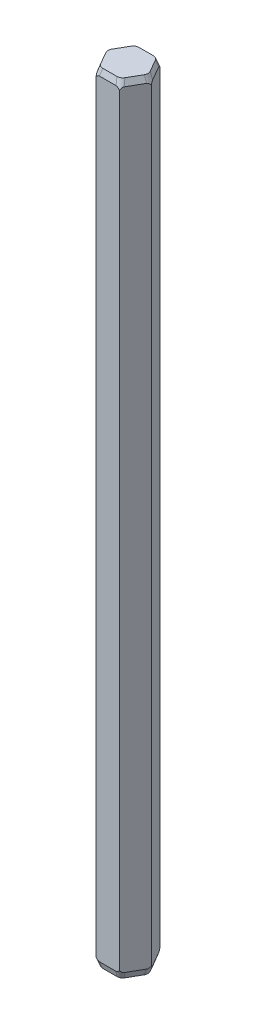
ISO-10303-21;
HEADER;
FILE_DESCRIPTION(('STEP AP214'),'2;1');
FILE_NAME('part.step','',(''),(''),'','','');
FILE_SCHEMA(('AUTOMOTIVE_DESIGN { 1 0 10303 214 1 1 1 1 }'));
ENDSEC;
DATA;
#1=APPLICATION_CONTEXT('core data for automotive mechanical design processes');
#2=APPLICATION_PROTOCOL_DEFINITION('international standard','automotive_design',2000,#1);
#3=PRODUCT_CONTEXT('',#1,'mechanical');
#4=PRODUCT('Part','Part','',(#3));
#5=PRODUCT_RELATED_PRODUCT_CATEGORY('part','',(#4));
#6=PRODUCT_DEFINITION_FORMATION('','',#4);
#7=PRODUCT_DEFINITION_CONTEXT('part definition',#1,'design');
#8=PRODUCT_DEFINITION('design','',#6,#7);
#9=PRODUCT_DEFINITION_SHAPE('','',#8);
#10=(LENGTH_UNIT() NAMED_UNIT(*) SI_UNIT(.MILLI.,.METRE.));
#11=(NAMED_UNIT(*) PLANE_ANGLE_UNIT() SI_UNIT($,.RADIAN.));
#12=(NAMED_UNIT(*) SI_UNIT($,.STERADIAN.) SOLID_ANGLE_UNIT());
#13=UNCERTAINTY_MEASURE_WITH_UNIT(LENGTH_MEASURE(1.E-05),#10,'distance_accuracy_value','');
#14=(GEOMETRIC_REPRESENTATION_CONTEXT(3) GLOBAL_UNCERTAINTY_ASSIGNED_CONTEXT((#13)) GLOBAL_UNIT_ASSIGNED_CONTEXT((#10,
#11,#12)) REPRESENTATION_CONTEXT('',''));
#15=CARTESIAN_POINT('',(0.,0.,0.));
#16=DIRECTION('',(0.,0.,1.));
#17=DIRECTION('',(1.,0.,0.));
#18=AXIS2_PLACEMENT_3D('',#15,#16,#17);
#19=CARTESIAN_POINT('',(0.75,50.,1.29903810567666));
#20=DIRECTION('',(-0.866025403784439,0.,-0.5));
#21=DIRECTION('',(-0.5,0.,0.866025403784439));
#22=AXIS2_PLACEMENT_3D('',#19,#20,#21);
#23=PLANE('',#22);
#24=DIRECTION('',(0.5,0.,-0.866025403784439));
#25=VECTOR('',#24,1.);
#26=CARTESIAN_POINT('',(0.75,0.399999999999991,1.29903810567666));
#27=LINE('',#26,#25);
#28=CARTESIAN_POINT('',(0.859179080829211,0.399999999999991,1.10993439055679));
#29=VERTEX_POINT('',#28);
#30=CARTESIAN_POINT('',(1.39082091917079,0.399999999999991,0.189103715119863));
#31=VERTEX_POINT('',#30);
#32=EDGE_CURVE('E400',#29,#31,#27,.T.);
#33=ORIENTED_EDGE('',*,*,#32,.T.);
#34=CARTESIAN_POINT('',(1.5,1.6286213947029,0.));
#35=DIRECTION('',(-0.866025403784439,0.,-0.5));
#36=DIRECTION('',(-0.0974910391928951,-0.980806805190685,0.168859433164783));
#37=AXIS2_PLACEMENT_3D('',#34,#35,#36);
#38=ELLIPSE('',#37,1.2501375383753,0.4);
#39=CARTESIAN_POINT('',(1.5,0.545970528245343,0.));
#40=VERTEX_POINT('',#39);
#41=EDGE_CURVE('E346',#31,#40,#38,.F.);
#42=ORIENTED_EDGE('',*,*,#41,.T.);
#43=DIRECTION('',(0.,-1.,0.));
#44=VECTOR('',#43,1.);
#45=CARTESIAN_POINT('',(1.5,50.,0.));
#46=LINE('',#45,#44);
#47=CARTESIAN_POINT('',(1.5,49.4540294717547,0.));
#48=VERTEX_POINT('',#47);
#49=EDGE_CURVE('E462',#48,#40,#46,.T.);
#50=ORIENTED_EDGE('',*,*,#49,.F.);
#51=CARTESIAN_POINT('',(1.5,48.3713786052971,0.));
#52=DIRECTION('',(-0.866025403784439,0.,-0.5));
#53=DIRECTION('',(-0.0974910391928951,0.980806805190685,0.168859433164783));
#54=AXIS2_PLACEMENT_3D('',#51,#52,#53);
#55=ELLIPSE('',#54,1.2501375383753,0.4);
#56=CARTESIAN_POINT('',(1.39082091917079,49.6,0.189103715119864));
#57=VERTEX_POINT('',#56);
#58=EDGE_CURVE('E342',#48,#57,#55,.F.);
#59=ORIENTED_EDGE('',*,*,#58,.T.);
#60=DIRECTION('',(-0.5,0.,0.866025403784439));
#61=VECTOR('',#60,1.);
#62=CARTESIAN_POINT('',(0.75,49.6,1.29903810567666));
#63=LINE('',#62,#61);
#64=CARTESIAN_POINT('',(0.859179080829211,49.6,1.10993439055679));
#65=VERTEX_POINT('',#64);
#66=EDGE_CURVE('E388',#57,#65,#63,.T.);
#67=ORIENTED_EDGE('',*,*,#66,.T.);
#68=CARTESIAN_POINT('',(0.75,48.3713786052971,1.29903810567666));
#69=DIRECTION('',(-0.866025403784439,0.,-0.5));
#70=DIRECTION('',(0.0974910391928953,0.980806805190685,-0.168859433164783));
#71=AXIS2_PLACEMENT_3D('',#68,#69,#70);
#72=ELLIPSE('',#71,1.2501375383753,0.4);
#73=CARTESIAN_POINT('',(0.75,49.4540294717547,1.29903810567666));
#74=VERTEX_POINT('',#73);
#75=EDGE_CURVE('E340',#65,#74,#72,.F.);
#76=ORIENTED_EDGE('',*,*,#75,.T.);
#77=DIRECTION('',(0.,-1.,0.));
#78=VECTOR('',#77,1.);
#79=CARTESIAN_POINT('',(0.75,50.,1.29903810567666));
#80=LINE('',#79,#78);
#81=CARTESIAN_POINT('',(0.75,0.545970528245364,1.29903810567666));
#82=VERTEX_POINT('',#81);
#83=EDGE_CURVE('E411',#74,#82,#80,.T.);
#84=ORIENTED_EDGE('',*,*,#83,.T.);
#85=CARTESIAN_POINT('',(0.75,1.6286213947029,1.29903810567666));
#86=DIRECTION('',(-0.866025403784439,0.,-0.5));
#87=DIRECTION('',(0.0974910391928953,-0.980806805190685,-0.168859433164783));
#88=AXIS2_PLACEMENT_3D('',#85,#86,#87);
#89=ELLIPSE('',#88,1.2501375383753,0.4);
#90=EDGE_CURVE('E344',#82,#29,#89,.F.);
#91=ORIENTED_EDGE('',*,*,#90,.T.);
#92=EDGE_LOOP('',(#33,#42,#50,#59,#67,#76,#84,#91));
#93=FACE_BOUND('',#92,.T.);
#94=ADVANCED_FACE('F34',(#93),#23,.F.);
#95=CARTESIAN_POINT('',(1.5,50.,0.));
#96=DIRECTION('',(-0.866025403784439,0.,0.5));
#97=DIRECTION('',(0.5,0.,0.866025403784439));
#98=AXIS2_PLACEMENT_3D('',#95,#96,#97);
#99=PLANE('',#98);
#100=DIRECTION('',(-0.5,0.,-0.866025403784439));
#101=VECTOR('',#100,1.);
#102=CARTESIAN_POINT('',(1.5,0.399999999999991,0.));
#103=LINE('',#102,#101);
#104=CARTESIAN_POINT('',(1.39082091917079,0.399999999999991,-0.189103715119864));
#105=VERTEX_POINT('',#104);
#106=CARTESIAN_POINT('',(0.859179080829211,0.399999999999991,-1.1099343905568));
#107=VERTEX_POINT('',#106);
#108=EDGE_CURVE('E468',#105,#107,#103,.T.);
#109=ORIENTED_EDGE('',*,*,#108,.T.);
#110=CARTESIAN_POINT('',(0.749999999999999,1.6286213947029,-1.29903810567666));
#111=DIRECTION('',(-0.866025403784439,0.,0.5));
#112=DIRECTION('',(-0.0974910391928956,0.980806805190684,-0.168859433164784));
#113=AXIS2_PLACEMENT_3D('',#110,#111,#112);
#114=ELLIPSE('',#113,1.2501375383753,0.4);
#115=CARTESIAN_POINT('',(0.75,0.545970528245364,-1.29903810567666));
#116=VERTEX_POINT('',#115);
#117=EDGE_CURVE('E333',#107,#116,#114,.F.);
#118=ORIENTED_EDGE('',*,*,#117,.T.);
#119=DIRECTION('',(0.,-1.,0.));
#120=VECTOR('',#119,1.);
#121=CARTESIAN_POINT('',(0.75,50.,-1.29903810567666));
#122=LINE('',#121,#120);
#123=CARTESIAN_POINT('',(0.75,49.4540294717547,-1.29903810567666));
#124=VERTEX_POINT('',#123);
#125=EDGE_CURVE('E239',#124,#116,#122,.T.);
#126=ORIENTED_EDGE('',*,*,#125,.F.);
#127=CARTESIAN_POINT('',(0.749999999999999,48.3713786052971,-1.29903810567666));
#128=DIRECTION('',(-0.866025403784439,0.,0.5));
#129=DIRECTION('',(0.0974910391928956,0.980806805190684,0.168859433164784));
#130=AXIS2_PLACEMENT_3D('',#127,#128,#129);
#131=ELLIPSE('',#130,1.2501375383753,0.4);
#132=CARTESIAN_POINT('',(0.859179080829211,49.6,-1.10993439055679));
#133=VERTEX_POINT('',#132);
#134=EDGE_CURVE('E329',#124,#133,#131,.F.);
#135=ORIENTED_EDGE('',*,*,#134,.T.);
#136=DIRECTION('',(0.5,0.,0.866025403784439));
#137=VECTOR('',#136,1.);
#138=CARTESIAN_POINT('',(1.5,49.6,0.));
#139=LINE('',#138,#137);
#140=CARTESIAN_POINT('',(1.39082091917079,49.6,-0.189103715119865));
#141=VERTEX_POINT('',#140);
#142=EDGE_CURVE('E465',#133,#141,#139,.T.);
#143=ORIENTED_EDGE('',*,*,#142,.T.);
#144=CARTESIAN_POINT('',(1.5,48.3713786052971,0.));
#145=DIRECTION('',(-0.866025403784439,0.,0.5));
#146=DIRECTION('',(-0.0974910391928956,0.980806805190684,-0.168859433164784));
#147=AXIS2_PLACEMENT_3D('',#144,#145,#146);
#148=ELLIPSE('',#147,1.2501375383753,0.4);
#149=EDGE_CURVE('E327',#141,#48,#148,.F.);
#150=ORIENTED_EDGE('',*,*,#149,.T.);
#151=ORIENTED_EDGE('',*,*,#49,.T.);
#152=CARTESIAN_POINT('',(1.5,1.6286213947029,0.));
#153=DIRECTION('',(-0.866025403784439,0.,0.5));
#154=DIRECTION('',(-0.0974910391928956,-0.980806805190684,-0.168859433164784));
#155=AXIS2_PLACEMENT_3D('',#152,#153,#154);
#156=ELLIPSE('',#155,1.2501375383753,0.4);
#157=EDGE_CURVE('E331',#40,#105,#156,.F.);
#158=ORIENTED_EDGE('',*,*,#157,.T.);
#159=EDGE_LOOP('',(#109,#118,#126,#135,#143,#150,#151,#158));
#160=FACE_BOUND('',#159,.T.);
#161=ADVANCED_FACE('F553',(#160),#99,.F.);
#162=CARTESIAN_POINT('',(0.75,50.,-1.29903810567666));
#163=DIRECTION('',(0.,0.,1.));
#164=DIRECTION('',(1.,0.,0.));
#165=AXIS2_PLACEMENT_3D('',#162,#163,#164);
#166=PLANE('',#165);
#167=DIRECTION('',(-1.,0.,0.));
#168=VECTOR('',#167,1.);
#169=CARTESIAN_POINT('',(0.75,0.399999999999991,-1.29903810567666));
#170=LINE('',#169,#168);
#171=CARTESIAN_POINT('',(0.531641838341576,0.399999999999991,-1.29903810567666));
#172=VERTEX_POINT('',#171);
#173=CARTESIAN_POINT('',(-0.531641838341577,0.399999999999991,-1.29903810567666));
#174=VERTEX_POINT('',#173);
#175=EDGE_CURVE('E237',#172,#174,#170,.T.);
#176=ORIENTED_EDGE('',*,*,#175,.T.);
#177=CARTESIAN_POINT('',(-0.749999999999998,1.6286213947029,-1.29903810567666));
#178=DIRECTION('',(0.,0.,1.));
#179=DIRECTION('',(-0.19498207838579,0.980806805190685,0.));
#180=AXIS2_PLACEMENT_3D('',#177,#178,#179);
#181=ELLIPSE('',#180,1.2501375383753,0.4);
#182=CARTESIAN_POINT('',(-0.75,0.54597052824535,-1.29903810567666));
#183=VERTEX_POINT('',#182);
#184=EDGE_CURVE('E242',#174,#183,#181,.F.);
#185=ORIENTED_EDGE('',*,*,#184,.T.);
#186=DIRECTION('',(0.,-1.,0.));
#187=VECTOR('',#186,1.);
#188=CARTESIAN_POINT('',(-0.75,50.,-1.29903810567666));
#189=LINE('',#188,#187);
#190=CARTESIAN_POINT('',(-0.75,49.4540294717547,-1.29903810567666));
#191=VERTEX_POINT('',#190);
#192=EDGE_CURVE('E455',#191,#183,#189,.T.);
#193=ORIENTED_EDGE('',*,*,#192,.F.);
#194=CARTESIAN_POINT('',(-0.749999999999998,48.3713786052971,-1.29903810567666));
#195=DIRECTION('',(0.,0.,1.));
#196=DIRECTION('',(-0.19498207838579,-0.980806805190685,0.));
#197=AXIS2_PLACEMENT_3D('',#194,#195,#196);
#198=ELLIPSE('',#197,1.2501375383753,0.4);
#199=CARTESIAN_POINT('',(-0.531641838341576,49.6,-1.29903810567666));
#200=VERTEX_POINT('',#199);
#201=EDGE_CURVE('E243',#191,#200,#198,.F.);
#202=ORIENTED_EDGE('',*,*,#201,.T.);
#203=DIRECTION('',(1.,0.,0.));
#204=VECTOR('',#203,1.);
#205=CARTESIAN_POINT('',(0.75,49.6,-1.29903810567666));
#206=LINE('',#205,#204);
#207=CARTESIAN_POINT('',(0.531641838341576,49.6,-1.29903810567666));
#208=VERTEX_POINT('',#207);
#209=EDGE_CURVE('E254',#200,#208,#206,.T.);
#210=ORIENTED_EDGE('',*,*,#209,.T.);
#211=CARTESIAN_POINT('',(0.749999999999999,48.3713786052971,-1.29903810567666));
#212=DIRECTION('',(0.,0.,1.));
#213=DIRECTION('',(-0.19498207838579,0.980806805190685,0.));
#214=AXIS2_PLACEMENT_3D('',#211,#212,#213);
#215=ELLIPSE('',#214,1.2501375383753,0.4);
#216=EDGE_CURVE('E262',#208,#124,#215,.F.);
#217=ORIENTED_EDGE('',*,*,#216,.T.);
#218=ORIENTED_EDGE('',*,*,#125,.T.);
#219=CARTESIAN_POINT('',(0.749999999999998,1.6286213947029,-1.29903810567666));
#220=DIRECTION('',(0.,0.,1.));
#221=DIRECTION('',(0.19498207838579,0.980806805190685,0.));
#222=AXIS2_PLACEMENT_3D('',#219,#220,#221);
#223=ELLIPSE('',#222,1.2501375383753,0.4);
#224=EDGE_CURVE('E234',#116,#172,#223,.F.);
#225=ORIENTED_EDGE('',*,*,#224,.T.);
#226=EDGE_LOOP('',(#176,#185,#193,#202,#210,#217,#218,#225));
#227=FACE_BOUND('',#226,.T.);
#228=ADVANCED_FACE('F236',(#227),#166,.F.);
#229=CARTESIAN_POINT('',(-0.75,50.,-1.29903810567666));
#230=DIRECTION('',(0.866025403784439,0.,0.5));
#231=DIRECTION('',(0.5,0.,-0.866025403784439));
#232=AXIS2_PLACEMENT_3D('',#229,#230,#231);
#233=PLANE('',#232);
#234=ORIENTED_EDGE('',*,*,#192,.T.);
#235=CARTESIAN_POINT('',(-0.749999999999999,1.6286213947029,-1.29903810567666));
#236=DIRECTION('',(0.866025403784439,0.,0.5));
#237=DIRECTION('',(0.0974910391928957,0.980806805190684,-0.168859433164784));
#238=AXIS2_PLACEMENT_3D('',#235,#236,#237);
#239=ELLIPSE('',#238,1.2501375383753,0.4);
#240=CARTESIAN_POINT('',(-0.859179080829211,0.399999999999991,-1.10993439055679));
#241=VERTEX_POINT('',#240);
#242=EDGE_CURVE('E278',#183,#241,#239,.F.);
#243=ORIENTED_EDGE('',*,*,#242,.T.);
#244=DIRECTION('',(-0.5,0.,0.866025403784439));
#245=VECTOR('',#244,1.);
#246=CARTESIAN_POINT('',(-0.75,0.399999999999991,-1.29903810567666));
#247=LINE('',#246,#245);
#248=CARTESIAN_POINT('',(-1.39082091917079,0.399999999999991,-0.189103715119864));
#249=VERTEX_POINT('',#248);
#250=EDGE_CURVE('E492',#241,#249,#247,.T.);
#251=ORIENTED_EDGE('',*,*,#250,.T.);
#252=CARTESIAN_POINT('',(-1.5,1.6286213947029,0.));
#253=DIRECTION('',(0.866025403784439,0.,0.5));
#254=DIRECTION('',(-0.0974910391928953,0.980806805190685,0.168859433164783));
#255=AXIS2_PLACEMENT_3D('',#252,#253,#254);
#256=ELLIPSE('',#255,1.2501375383753,0.4);
#257=CARTESIAN_POINT('',(-1.5,0.545970528245364,0.));
#258=VERTEX_POINT('',#257);
#259=EDGE_CURVE('E276',#249,#258,#256,.F.);
#260=ORIENTED_EDGE('',*,*,#259,.T.);
#261=DIRECTION('',(0.,-1.,0.));
#262=VECTOR('',#261,1.);
#263=CARTESIAN_POINT('',(-1.5,50.,0.));
#264=LINE('',#263,#262);
#265=CARTESIAN_POINT('',(-1.5,49.4540294717547,0.));
#266=VERTEX_POINT('',#265);
#267=EDGE_CURVE('E453',#266,#258,#264,.T.);
#268=ORIENTED_EDGE('',*,*,#267,.F.);
#269=CARTESIAN_POINT('',(-1.5,48.3713786052971,0.));
#270=DIRECTION('',(0.866025403784439,0.,0.5));
#271=DIRECTION('',(-0.0974910391928953,-0.980806805190685,0.168859433164783));
#272=AXIS2_PLACEMENT_3D('',#269,#270,#271);
#273=ELLIPSE('',#272,1.2501375383753,0.4);
#274=CARTESIAN_POINT('',(-1.39082091917079,49.6,-0.189103715119864));
#275=VERTEX_POINT('',#274);
#276=EDGE_CURVE('E274',#266,#275,#273,.F.);
#277=ORIENTED_EDGE('',*,*,#276,.T.);
#278=DIRECTION('',(0.5,0.,-0.866025403784439));
#279=VECTOR('',#278,1.);
#280=CARTESIAN_POINT('',(-0.75,49.6,-1.29903810567666));
#281=LINE('',#280,#279);
#282=CARTESIAN_POINT('',(-0.859179080829212,49.6,-1.10993439055679));
#283=VERTEX_POINT('',#282);
#284=EDGE_CURVE('E253',#275,#283,#281,.T.);
#285=ORIENTED_EDGE('',*,*,#284,.T.);
#286=CARTESIAN_POINT('',(-0.749999999999999,48.3713786052971,-1.29903810567666));
#287=DIRECTION('',(0.866025403784439,0.,0.5));
#288=DIRECTION('',(0.0974910391928957,-0.980806805190684,-0.168859433164784));
#289=AXIS2_PLACEMENT_3D('',#286,#287,#288);
#290=ELLIPSE('',#289,1.2501375383753,0.4);
#291=EDGE_CURVE('E272',#283,#191,#290,.F.);
#292=ORIENTED_EDGE('',*,*,#291,.T.);
#293=EDGE_LOOP('',(#234,#243,#251,#260,#268,#277,#285,#292));
#294=FACE_BOUND('',#293,.T.);
#295=ADVANCED_FACE('F500',(#294),#233,.F.);
#296=CARTESIAN_POINT('',(-1.5,50.,0.));
#297=DIRECTION('',(0.866025403784439,0.,-0.5));
#298=DIRECTION('',(-0.5,0.,-0.866025403784439));
#299=AXIS2_PLACEMENT_3D('',#296,#297,#298);
#300=PLANE('',#299);
#301=ORIENTED_EDGE('',*,*,#267,.T.);
#302=CARTESIAN_POINT('',(-1.5,1.6286213947029,0.));
#303=DIRECTION('',(0.866025403784439,0.,-0.5));
#304=DIRECTION('',(-0.0974910391928952,0.980806805190685,-0.168859433164783));
#305=AXIS2_PLACEMENT_3D('',#302,#303,#304);
#306=ELLIPSE('',#305,1.2501375383753,0.4);
#307=CARTESIAN_POINT('',(-1.39082091917079,0.399999999999991,0.189103715119863));
#308=VERTEX_POINT('',#307);
#309=EDGE_CURVE('E302',#258,#308,#306,.F.);
#310=ORIENTED_EDGE('',*,*,#309,.T.);
#311=DIRECTION('',(0.5,0.,0.866025403784439));
#312=VECTOR('',#311,1.);
#313=CARTESIAN_POINT('',(-1.5,0.399999999999991,0.));
#314=LINE('',#313,#312);
#315=CARTESIAN_POINT('',(-0.859179080829212,0.399999999999991,1.10993439055679));
#316=VERTEX_POINT('',#315);
#317=EDGE_CURVE('E416',#308,#316,#314,.T.);
#318=ORIENTED_EDGE('',*,*,#317,.T.);
#319=CARTESIAN_POINT('',(-0.75,1.6286213947029,1.29903810567666));
#320=DIRECTION('',(0.866025403784439,0.,-0.5));
#321=DIRECTION('',(-0.0974910391928954,-0.980806805190685,-0.168859433164784));
#322=AXIS2_PLACEMENT_3D('',#319,#320,#321);
#323=ELLIPSE('',#322,1.2501375383753,0.4);
#324=CARTESIAN_POINT('',(-0.75,0.54597052824535,1.29903810567666));
#325=VERTEX_POINT('',#324);
#326=EDGE_CURVE('E300',#316,#325,#323,.F.);
#327=ORIENTED_EDGE('',*,*,#326,.T.);
#328=DIRECTION('',(0.,-1.,0.));
#329=VECTOR('',#328,1.);
#330=CARTESIAN_POINT('',(-0.75,50.,1.29903810567666));
#331=LINE('',#330,#329);
#332=CARTESIAN_POINT('',(-0.75,49.4540294717547,1.29903810567666));
#333=VERTEX_POINT('',#332);
#334=EDGE_CURVE('E445',#333,#325,#331,.T.);
#335=ORIENTED_EDGE('',*,*,#334,.F.);
#336=CARTESIAN_POINT('',(-0.75,48.3713786052971,1.29903810567666));
#337=DIRECTION('',(0.866025403784439,0.,-0.5));
#338=DIRECTION('',(0.0974910391928954,-0.980806805190685,0.168859433164784));
#339=AXIS2_PLACEMENT_3D('',#336,#337,#338);
#340=ELLIPSE('',#339,1.2501375383753,0.4);
#341=CARTESIAN_POINT('',(-0.859179080829212,49.6,1.10993439055679));
#342=VERTEX_POINT('',#341);
#343=EDGE_CURVE('E298',#333,#342,#340,.F.);
#344=ORIENTED_EDGE('',*,*,#343,.T.);
#345=DIRECTION('',(-0.5,0.,-0.866025403784439));
#346=VECTOR('',#345,1.);
#347=CARTESIAN_POINT('',(-1.5,49.6,0.));
#348=LINE('',#347,#346);
#349=CARTESIAN_POINT('',(-1.39082091917079,49.6,0.189103715119864));
#350=VERTEX_POINT('',#349);
#351=EDGE_CURVE('E421',#342,#350,#348,.T.);
#352=ORIENTED_EDGE('',*,*,#351,.T.);
#353=CARTESIAN_POINT('',(-1.5,48.3713786052971,0.));
#354=DIRECTION('',(0.866025403784439,0.,-0.5));
#355=DIRECTION('',(-0.0974910391928952,-0.980806805190685,-0.168859433164783));
#356=AXIS2_PLACEMENT_3D('',#353,#354,#355);
#357=ELLIPSE('',#356,1.2501375383753,0.4);
#358=EDGE_CURVE('E296',#350,#266,#357,.F.);
#359=ORIENTED_EDGE('',*,*,#358,.T.);
#360=EDGE_LOOP('',(#301,#310,#318,#327,#335,#344,#352,#359));
#361=FACE_BOUND('',#360,.T.);
#362=ADVANCED_FACE('F449',(#361),#300,.F.);
#363=CARTESIAN_POINT('',(-0.75,50.,1.29903810567666));
#364=DIRECTION('',(0.,0.,-1.));
#365=DIRECTION('',(-1.,0.,0.));
#366=AXIS2_PLACEMENT_3D('',#363,#364,#365);
#367=PLANE('',#366);
#368=ORIENTED_EDGE('',*,*,#334,.T.);
#369=CARTESIAN_POINT('',(-0.75,1.6286213947029,1.29903810567666));
#370=DIRECTION('',(0.,0.,-1.));
#371=DIRECTION('',(0.19498207838579,-0.980806805190685,0.));
#372=AXIS2_PLACEMENT_3D('',#369,#370,#371);
#373=ELLIPSE('',#372,1.2501375383753,0.4);
#374=CARTESIAN_POINT('',(-0.531641838341577,0.399999999999991,1.29903810567666));
#375=VERTEX_POINT('',#374);
#376=EDGE_CURVE('E319',#325,#375,#373,.F.);
#377=ORIENTED_EDGE('',*,*,#376,.T.);
#378=DIRECTION('',(1.,0.,0.));
#379=VECTOR('',#378,1.);
#380=CARTESIAN_POINT('',(-0.75,0.399999999999991,1.29903810567666));
#381=LINE('',#380,#379);
#382=CARTESIAN_POINT('',(0.531641838341577,0.399999999999991,1.29903810567666));
#383=VERTEX_POINT('',#382);
#384=EDGE_CURVE('E401',#375,#383,#381,.T.);
#385=ORIENTED_EDGE('',*,*,#384,.T.);
#386=CARTESIAN_POINT('',(0.75,1.6286213947029,1.29903810567666));
#387=DIRECTION('',(0.,0.,-1.));
#388=DIRECTION('',(-0.194982078385791,-0.980806805190685,0.));
#389=AXIS2_PLACEMENT_3D('',#386,#387,#388);
#390=ELLIPSE('',#389,1.2501375383753,0.4);
#391=EDGE_CURVE('E317',#383,#82,#390,.F.);
#392=ORIENTED_EDGE('',*,*,#391,.T.);
#393=ORIENTED_EDGE('',*,*,#83,.F.);
#394=CARTESIAN_POINT('',(0.75,48.3713786052971,1.29903810567666));
#395=DIRECTION('',(0.,0.,-1.));
#396=DIRECTION('',(-0.194982078385791,0.980806805190685,0.));
#397=AXIS2_PLACEMENT_3D('',#394,#395,#396);
#398=ELLIPSE('',#397,1.2501375383753,0.4);
#399=CARTESIAN_POINT('',(0.531641838341576,49.6,1.29903810567666));
#400=VERTEX_POINT('',#399);
#401=EDGE_CURVE('E313',#74,#400,#398,.F.);
#402=ORIENTED_EDGE('',*,*,#401,.T.);
#403=DIRECTION('',(-1.,0.,0.));
#404=VECTOR('',#403,1.);
#405=CARTESIAN_POINT('',(-0.75,49.6,1.29903810567666));
#406=LINE('',#405,#404);
#407=CARTESIAN_POINT('',(-0.531641838341577,49.6,1.29903810567666));
#408=VERTEX_POINT('',#407);
#409=EDGE_CURVE('E410',#400,#408,#406,.T.);
#410=ORIENTED_EDGE('',*,*,#409,.T.);
#411=CARTESIAN_POINT('',(-0.75,48.3713786052971,1.29903810567666));
#412=DIRECTION('',(0.,0.,-1.));
#413=DIRECTION('',(-0.19498207838579,-0.980806805190685,0.));
#414=AXIS2_PLACEMENT_3D('',#411,#412,#413);
#415=ELLIPSE('',#414,1.2501375383753,0.4);
#416=EDGE_CURVE('E315',#408,#333,#415,.F.);
#417=ORIENTED_EDGE('',*,*,#416,.T.);
#418=EDGE_LOOP('',(#368,#377,#385,#392,#393,#402,#410,#417));
#419=FACE_BOUND('',#418,.T.);
#420=ADVANCED_FACE('F409',(#419),#367,.F.);
#421=CARTESIAN_POINT('',(1.5,50.,0.));
#422=DIRECTION('',(0.,1.,0.));
#423=DIRECTION('',(0.,0.,1.));
#424=AXIS2_PLACEMENT_3D('',#421,#422,#423);
#425=PLANE('',#424);
#426=DIRECTION('',(0.5,0.,0.866025403784439));
#427=VECTOR('',#426,1.);
#428=CARTESIAN_POINT('',(-0.630721415866678,50.,1.23017258301873));
#429=LINE('',#428,#427);
#430=CARTESIAN_POINT('',(-1.23178280699303,50.,0.189103715119864));
#431=VERTEX_POINT('',#430);
#432=CARTESIAN_POINT('',(-0.779660024740331,50.,0.972203345240932));
#433=VERTEX_POINT('',#432);
#434=EDGE_CURVE('E265',#431,#433,#429,.T.);
#435=ORIENTED_EDGE('',*,*,#434,.T.);
#436=CARTESIAN_POINT('',(-0.426233909917664,50.,0.738258787886129));
#437=DIRECTION('',(0.,1.,0.));
#438=DIRECTION('',(-0.499999999999999,0.,0.866025403784439));
#439=AXIS2_PLACEMENT_3D('',#436,#437,#438);
#440=ELLIPSE('',#439,0.43045687487258,0.4);
#441=CARTESIAN_POINT('',(-0.452122782252696,50.,1.1613070603608));
#442=VERTEX_POINT('',#441);
#443=EDGE_CURVE('E368',#433,#442,#440,.T.);
#444=ORIENTED_EDGE('',*,*,#443,.T.);
#445=DIRECTION('',(1.,0.,0.));
#446=VECTOR('',#445,1.);
#447=CARTESIAN_POINT('',(0.75,50.,1.1613070603608));
#448=LINE('',#447,#446);
#449=CARTESIAN_POINT('',(0.452122782252695,50.,1.1613070603608));
#450=VERTEX_POINT('',#449);
#451=EDGE_CURVE('E260',#442,#450,#448,.T.);
#452=ORIENTED_EDGE('',*,*,#451,.T.);
#453=CARTESIAN_POINT('',(0.426233909917663,50.,0.738258787886129));
#454=DIRECTION('',(0.,1.,0.));
#455=DIRECTION('',(-0.500000000000001,0.,-0.866025403784438));
#456=AXIS2_PLACEMENT_3D('',#453,#454,#455);
#457=ELLIPSE('',#456,0.43045687487258,0.4);
#458=CARTESIAN_POINT('',(0.77966002474033,50.,0.972203345240933));
#459=VERTEX_POINT('',#458);
#460=EDGE_CURVE('E359',#450,#459,#457,.T.);
#461=ORIENTED_EDGE('',*,*,#460,.T.);
#462=DIRECTION('',(0.5,0.,-0.866025403784439));
#463=VECTOR('',#462,1.);
#464=CARTESIAN_POINT('',(1.38072141586668,50.,-0.0688655226579313));
#465=LINE('',#464,#463);
#466=CARTESIAN_POINT('',(1.23178280699303,50.,0.189103715119864));
#467=VERTEX_POINT('',#466);
#468=EDGE_CURVE('E391',#459,#467,#465,.T.);
#469=ORIENTED_EDGE('',*,*,#468,.T.);
#470=CARTESIAN_POINT('',(0.852467819835324,50.,0.));
#471=DIRECTION('',(0.,1.,0.));
#472=DIRECTION('',(-1.,0.,0.));
#473=AXIS2_PLACEMENT_3D('',#470,#471,#472);
#474=ELLIPSE('',#473,0.43045687487258,0.4);
#475=CARTESIAN_POINT('',(1.23178280699303,50.,-0.189103715119865));
#476=VERTEX_POINT('',#475);
#477=EDGE_CURVE('E361',#467,#476,#474,.T.);
#478=ORIENTED_EDGE('',*,*,#477,.T.);
#479=DIRECTION('',(-0.5,0.,-0.866025403784439));
#480=VECTOR('',#479,1.);
#481=CARTESIAN_POINT('',(0.630721415866678,50.,-1.23017258301873));
#482=LINE('',#481,#480);
#483=CARTESIAN_POINT('',(0.77966002474033,50.,-0.972203345240932));
#484=VERTEX_POINT('',#483);
#485=EDGE_CURVE('E427',#476,#484,#482,.T.);
#486=ORIENTED_EDGE('',*,*,#485,.T.);
#487=CARTESIAN_POINT('',(0.426233909917663,50.,-0.738258787886128));
#488=DIRECTION('',(0.,1.,0.));
#489=DIRECTION('',(-0.499999999999999,0.,0.866025403784439));
#490=AXIS2_PLACEMENT_3D('',#487,#488,#489);
#491=ELLIPSE('',#490,0.43045687487258,0.4);
#492=CARTESIAN_POINT('',(0.452122782252695,50.,-1.1613070603608));
#493=VERTEX_POINT('',#492);
#494=EDGE_CURVE('E363',#484,#493,#491,.T.);
#495=ORIENTED_EDGE('',*,*,#494,.T.);
#496=DIRECTION('',(-1.,0.,0.));
#497=VECTOR('',#496,1.);
#498=CARTESIAN_POINT('',(-0.75,50.,-1.1613070603608));
#499=LINE('',#498,#497);
#500=CARTESIAN_POINT('',(-0.452122782252695,50.,-1.1613070603608));
#501=VERTEX_POINT('',#500);
#502=EDGE_CURVE('E430',#493,#501,#499,.T.);
#503=ORIENTED_EDGE('',*,*,#502,.T.);
#504=CARTESIAN_POINT('',(-0.426233909917662,50.,-0.738258787886127));
#505=DIRECTION('',(0.,1.,0.));
#506=DIRECTION('',(-0.499999999999998,0.,-0.86602540378444));
#507=AXIS2_PLACEMENT_3D('',#504,#505,#506);
#508=ELLIPSE('',#507,0.43045687487258,0.4);
#509=CARTESIAN_POINT('',(-0.779660024740331,50.,-0.972203345240932));
#510=VERTEX_POINT('',#509);
#511=EDGE_CURVE('E56',#501,#510,#508,.T.);
#512=ORIENTED_EDGE('',*,*,#511,.T.);
#513=DIRECTION('',(-0.5,0.,0.866025403784439));
#514=VECTOR('',#513,1.);
#515=CARTESIAN_POINT('',(-1.38072141586668,50.,0.0688655226579305));
#516=LINE('',#515,#514);
#517=CARTESIAN_POINT('',(-1.23178280699303,50.,-0.189103715119865));
#518=VERTEX_POINT('',#517);
#519=EDGE_CURVE('E432',#510,#518,#516,.T.);
#520=ORIENTED_EDGE('',*,*,#519,.T.);
#521=CARTESIAN_POINT('',(-0.852467819835326,50.,0.));
#522=DIRECTION('',(0.,1.,0.));
#523=DIRECTION('',(-1.,0.,0.));
#524=AXIS2_PLACEMENT_3D('',#521,#522,#523);
#525=ELLIPSE('',#524,0.43045687487258,0.4);
#526=EDGE_CURVE('E366',#518,#431,#525,.T.);
#527=ORIENTED_EDGE('',*,*,#526,.T.);
#528=EDGE_LOOP('',(#435,#444,#452,#461,#469,#478,#486,#495,#503,#512,#520,#527));
#529=FACE_BOUND('',#528,.T.);
#530=ADVANCED_FACE('F436',(#529),#425,.T.);
#531=CARTESIAN_POINT('',(1.5,0.,0.));
#532=DIRECTION('',(0.,1.,0.));
#533=DIRECTION('',(0.,0.,1.));
#534=AXIS2_PLACEMENT_3D('',#531,#532,#533);
#535=PLANE('',#534);
#536=DIRECTION('',(0.5,0.,-0.866025403784439));
#537=VECTOR('',#536,1.);
#538=CARTESIAN_POINT('',(-0.630721415866678,0.,-1.23017258301873));
#539=LINE('',#538,#537);
#540=CARTESIAN_POINT('',(-1.23178280699303,0.,-0.189103715119864));
#541=VERTEX_POINT('',#540);
#542=CARTESIAN_POINT('',(-0.77966002474033,0.,-0.972203345240933));
#543=VERTEX_POINT('',#542);
#544=EDGE_CURVE('E480',#541,#543,#539,.T.);
#545=ORIENTED_EDGE('',*,*,#544,.T.);
#546=CARTESIAN_POINT('',(-0.426233909917663,0.,-0.738258787886129));
#547=DIRECTION('',(0.,1.,0.));
#548=DIRECTION('',(-0.499999999999998,0.,-0.86602540378444));
#549=AXIS2_PLACEMENT_3D('',#546,#547,#548);
#550=ELLIPSE('',#549,0.43045687487258,0.4);
#551=CARTESIAN_POINT('',(-0.452122782252696,0.,-1.1613070603608));
#552=VERTEX_POINT('',#551);
#553=EDGE_CURVE('E294',#543,#552,#550,.F.);
#554=ORIENTED_EDGE('',*,*,#553,.T.);
#555=DIRECTION('',(1.,0.,0.));
#556=VECTOR('',#555,1.);
#557=CARTESIAN_POINT('',(1.5,0.,-1.1613070603608));
#558=LINE('',#557,#556);
#559=CARTESIAN_POINT('',(0.452122782252695,0.,-1.1613070603608));
#560=VERTEX_POINT('',#559);
#561=EDGE_CURVE('E483',#552,#560,#558,.T.);
#562=ORIENTED_EDGE('',*,*,#561,.T.);
#563=CARTESIAN_POINT('',(0.426233909917663,0.,-0.738258787886129));
#564=DIRECTION('',(0.,1.,0.));
#565=DIRECTION('',(0.499999999999999,0.,-0.866025403784439));
#566=AXIS2_PLACEMENT_3D('',#563,#564,#565);
#567=ELLIPSE('',#566,0.43045687487258,0.4);
#568=CARTESIAN_POINT('',(0.77966002474033,0.,-0.972203345240934));
#569=VERTEX_POINT('',#568);
#570=EDGE_CURVE('E259',#560,#569,#567,.F.);
#571=ORIENTED_EDGE('',*,*,#570,.T.);
#572=DIRECTION('',(0.5,0.,0.866025403784439));
#573=VECTOR('',#572,1.);
#574=CARTESIAN_POINT('',(1.38072141586668,0.,0.0688655226579303));
#575=LINE('',#574,#573);
#576=CARTESIAN_POINT('',(1.23178280699303,0.,-0.189103715119864));
#577=VERTEX_POINT('',#576);
#578=EDGE_CURVE('E485',#569,#577,#575,.T.);
#579=ORIENTED_EDGE('',*,*,#578,.T.);
#580=CARTESIAN_POINT('',(0.852467819835326,0.,0.));
#581=DIRECTION('',(0.,1.,0.));
#582=DIRECTION('',(-1.,0.,0.));
#583=AXIS2_PLACEMENT_3D('',#580,#581,#582);
#584=ELLIPSE('',#583,0.43045687487258,0.4);
#585=CARTESIAN_POINT('',(1.23178280699303,0.,0.189103715119863));
#586=VERTEX_POINT('',#585);
#587=EDGE_CURVE('E287',#577,#586,#584,.F.);
#588=ORIENTED_EDGE('',*,*,#587,.T.);
#589=DIRECTION('',(-0.5,0.,0.866025403784439));
#590=VECTOR('',#589,1.);
#591=CARTESIAN_POINT('',(1.38072141586668,0.,-0.0688655226579313));
#592=LINE('',#591,#590);
#593=CARTESIAN_POINT('',(0.77966002474033,0.,0.972203345240933));
#594=VERTEX_POINT('',#593);
#595=EDGE_CURVE('E471',#586,#594,#592,.T.);
#596=ORIENTED_EDGE('',*,*,#595,.T.);
#597=CARTESIAN_POINT('',(0.426233909917663,0.,0.738258787886129));
#598=DIRECTION('',(0.,1.,0.));
#599=DIRECTION('',(-0.500000000000001,0.,-0.866025403784438));
#600=AXIS2_PLACEMENT_3D('',#597,#598,#599);
#601=ELLIPSE('',#600,0.43045687487258,0.4);
#602=CARTESIAN_POINT('',(0.452122782252695,0.,1.1613070603608));
#603=VERTEX_POINT('',#602);
#604=EDGE_CURVE('E285',#594,#603,#601,.F.);
#605=ORIENTED_EDGE('',*,*,#604,.T.);
#606=DIRECTION('',(-1.,0.,0.));
#607=VECTOR('',#606,1.);
#608=CARTESIAN_POINT('',(1.5,0.,1.1613070603608));
#609=LINE('',#608,#607);
#610=CARTESIAN_POINT('',(-0.452122782252696,0.,1.1613070603608));
#611=VERTEX_POINT('',#610);
#612=EDGE_CURVE('E474',#603,#611,#609,.T.);
#613=ORIENTED_EDGE('',*,*,#612,.T.);
#614=CARTESIAN_POINT('',(-0.426233909917664,0.,0.738258787886128));
#615=DIRECTION('',(0.,1.,0.));
#616=DIRECTION('',(0.499999999999999,0.,-0.866025403784439));
#617=AXIS2_PLACEMENT_3D('',#614,#615,#616);
#618=ELLIPSE('',#617,0.43045687487258,0.4);
#619=CARTESIAN_POINT('',(-0.779660024740331,0.,0.972203345240933));
#620=VERTEX_POINT('',#619);
#621=EDGE_CURVE('E290',#611,#620,#618,.F.);
#622=ORIENTED_EDGE('',*,*,#621,.T.);
#623=DIRECTION('',(-0.5,0.,-0.866025403784439));
#624=VECTOR('',#623,1.);
#625=CARTESIAN_POINT('',(-0.630721415866679,0.,1.23017258301873));
#626=LINE('',#625,#624);
#627=CARTESIAN_POINT('',(-1.23178280699303,0.,0.189103715119863));
#628=VERTEX_POINT('',#627);
#629=EDGE_CURVE('E477',#620,#628,#626,.T.);
#630=ORIENTED_EDGE('',*,*,#629,.T.);
#631=CARTESIAN_POINT('',(-0.852467819835327,0.,0.));
#632=DIRECTION('',(0.,1.,0.));
#633=DIRECTION('',(-1.,0.,0.));
#634=AXIS2_PLACEMENT_3D('',#631,#632,#633);
#635=ELLIPSE('',#634,0.43045687487258,0.4);
#636=EDGE_CURVE('E292',#628,#541,#635,.F.);
#637=ORIENTED_EDGE('',*,*,#636,.T.);
#638=EDGE_LOOP('',(#545,#554,#562,#571,#579,#588,#596,#605,#613,#622,#630,#637));
#639=FACE_BOUND('',#638,.T.);
#640=ADVANCED_FACE('F576',(#639),#535,.F.);
#641=CARTESIAN_POINT('',(-1.5,0.399999999999991,0.));
#642=DIRECTION('',(0.818843106219087,0.325568154457154,-0.472759287799659));
#643=DIRECTION('',(-0.5,0.,-0.866025403784439));
#644=AXIS2_PLACEMENT_3D('',#641,#642,#643);
#645=PLANE('',#644);
#646=ORIENTED_EDGE('',*,*,#317,.F.);
#647=DIRECTION('',(0.369463519951547,-0.929245235352333,0.));
#648=VECTOR('',#647,1.);
#649=CARTESIAN_POINT('',(-1.40572422318429,0.437483603922149,0.189103715119863));
#650=LINE('',#649,#648);
#651=EDGE_CURVE('E306',#308,#628,#650,.T.);
#652=ORIENTED_EDGE('',*,*,#651,.T.);
#653=ORIENTED_EDGE('',*,*,#629,.F.);
#654=DIRECTION('',(-0.184731759975773,0.929245235352333,0.319964794049659));
#655=VECTOR('',#654,1.);
#656=CARTESIAN_POINT('',(-0.81544199812034,0.179991942258541,1.03417954113019));
#657=LINE('',#656,#655);
#658=EDGE_CURVE('E304',#620,#316,#657,.T.);
#659=ORIENTED_EDGE('',*,*,#658,.T.);
#660=EDGE_LOOP('',(#646,#652,#653,#659));
#661=FACE_BOUND('',#660,.T.);
#662=ADVANCED_FACE('F526',(#661),#645,.F.);
#663=CARTESIAN_POINT('',(-0.75,0.399999999999991,1.29903810567666));
#664=DIRECTION('',(0.,0.325568154457154,-0.945518575599318));
#665=DIRECTION('',(0.,0.945518575599318,0.325568154457154));
#666=AXIS2_PLACEMENT_3D('',#663,#664,#665);
#667=PLANE('',#666);
#668=ORIENTED_EDGE('',*,*,#384,.F.);
#669=DIRECTION('',(-0.184731759975773,0.929245235352333,0.319964794049659));
#670=VECTOR('',#669,1.);
#671=CARTESIAN_POINT('',(-0.539093490348326,0.437483603922149,1.31194474555267));
#672=LINE('',#671,#670);
#673=EDGE_CURVE('E310',#375,#611,#672,.F.);
#674=ORIENTED_EDGE('',*,*,#673,.T.);
#675=ORIENTED_EDGE('',*,*,#612,.F.);
#676=DIRECTION('',(0.184731759975774,0.929245235352333,0.319964794049659));
#677=VECTOR('',#676,1.);
#678=CARTESIAN_POINT('',(0.487904755632705,0.179991942258541,1.22328325625005));
#679=LINE('',#678,#677);
#680=EDGE_CURVE('E308',#603,#383,#679,.T.);
#681=ORIENTED_EDGE('',*,*,#680,.T.);
#682=EDGE_LOOP('',(#668,#674,#675,#681));
#683=FACE_BOUND('',#682,.T.);
#684=ADVANCED_FACE('F535',(#683),#667,.F.);
#685=CARTESIAN_POINT('',(-0.75,0.399999999999991,-1.29903810567666));
#686=DIRECTION('',(0.818843106219086,0.325568154457153,0.472759287799659));
#687=DIRECTION('',(0.5,0.,-0.866025403784439));
#688=AXIS2_PLACEMENT_3D('',#685,#686,#687);
#689=PLANE('',#688);
#690=ORIENTED_EDGE('',*,*,#250,.F.);
#691=DIRECTION('',(0.184731759975773,-0.929245235352333,0.319964794049659));
#692=VECTOR('',#691,1.);
#693=CARTESIAN_POINT('',(-0.86663073283596,0.43748360392215,-1.12284103043281));
#694=LINE('',#693,#692);
#695=EDGE_CURVE('E283',#241,#543,#694,.T.);
#696=ORIENTED_EDGE('',*,*,#695,.T.);
#697=ORIENTED_EDGE('',*,*,#544,.F.);
#698=DIRECTION('',(0.369463519951547,-0.929245235352333,0.));
#699=VECTOR('',#698,1.);
#700=CARTESIAN_POINT('',(-1.30334675375305,0.179991942258542,-0.189103715119864));
#701=LINE('',#700,#699);
#702=EDGE_CURVE('E280',#541,#249,#701,.F.);
#703=ORIENTED_EDGE('',*,*,#702,.T.);
#704=EDGE_LOOP('',(#690,#696,#697,#703));
#705=FACE_BOUND('',#704,.T.);
#706=ADVANCED_FACE('F516',(#705),#689,.F.);
#707=CARTESIAN_POINT('',(0.75,0.399999999999991,1.29903810567666));
#708=DIRECTION('',(-0.818843106219087,0.325568154457154,-0.472759287799659));
#709=DIRECTION('',(-0.5,0.,0.866025403784439));
#710=AXIS2_PLACEMENT_3D('',#707,#708,#709);
#711=PLANE('',#710);
#712=ORIENTED_EDGE('',*,*,#595,.F.);
#713=DIRECTION('',(0.369463519951548,0.929245235352333,0.));
#714=VECTOR('',#713,1.);
#715=CARTESIAN_POINT('',(1.30334675375305,0.179991942258542,0.189103715119863));
#716=LINE('',#715,#714);
#717=EDGE_CURVE('E338',#586,#31,#716,.T.);
#718=ORIENTED_EDGE('',*,*,#717,.T.);
#719=ORIENTED_EDGE('',*,*,#32,.F.);
#720=DIRECTION('',(0.184731759975774,0.929245235352333,0.319964794049659));
#721=VECTOR('',#720,1.);
#722=CARTESIAN_POINT('',(0.86663073283596,0.437483603922149,1.12284103043281));
#723=LINE('',#722,#721);
#724=EDGE_CURVE('E335',#29,#594,#723,.F.);
#725=ORIENTED_EDGE('',*,*,#724,.T.);
#726=EDGE_LOOP('',(#712,#718,#719,#725));
#727=FACE_BOUND('',#726,.T.);
#728=ADVANCED_FACE('F546',(#727),#711,.F.);
#729=CARTESIAN_POINT('',(0.75,0.399999999999991,-1.29903810567666));
#730=DIRECTION('',(0.,0.325568154457154,0.945518575599318));
#731=DIRECTION('',(0.,-0.945518575599318,0.325568154457154));
#732=AXIS2_PLACEMENT_3D('',#729,#730,#731);
#733=PLANE('',#732);
#734=ORIENTED_EDGE('',*,*,#561,.F.);
#735=DIRECTION('',(0.184731759975773,-0.929245235352333,0.319964794049659));
#736=VECTOR('',#735,1.);
#737=CARTESIAN_POINT('',(-0.487904755632706,0.179991942258542,-1.22328325625005));
#738=LINE('',#737,#736);
#739=EDGE_CURVE('E252',#552,#174,#738,.F.);
#740=ORIENTED_EDGE('',*,*,#739,.T.);
#741=ORIENTED_EDGE('',*,*,#175,.F.);
#742=DIRECTION('',(-0.184731759975773,-0.929245235352333,0.319964794049659));
#743=VECTOR('',#742,1.);
#744=CARTESIAN_POINT('',(0.539093490348325,0.437483603922149,-1.31194474555267));
#745=LINE('',#744,#743);
#746=EDGE_CURVE('E249',#172,#560,#745,.T.);
#747=ORIENTED_EDGE('',*,*,#746,.T.);
#748=EDGE_LOOP('',(#734,#740,#741,#747));
#749=FACE_BOUND('',#748,.T.);
#750=ADVANCED_FACE('F248',(#749),#733,.F.);
#751=CARTESIAN_POINT('',(1.5,0.399999999999991,0.));
#752=DIRECTION('',(-0.818843106219087,0.325568154457154,0.472759287799659));
#753=DIRECTION('',(0.5,0.,0.866025403784439));
#754=AXIS2_PLACEMENT_3D('',#751,#752,#753);
#755=PLANE('',#754);
#756=ORIENTED_EDGE('',*,*,#578,.F.);
#757=DIRECTION('',(-0.184731759975773,-0.929245235352333,0.319964794049659));
#758=VECTOR('',#757,1.);
#759=CARTESIAN_POINT('',(0.815441998120339,0.179991942258541,-1.03417954113019));
#760=LINE('',#759,#758);
#761=EDGE_CURVE('E324',#569,#107,#760,.F.);
#762=ORIENTED_EDGE('',*,*,#761,.T.);
#763=ORIENTED_EDGE('',*,*,#108,.F.);
#764=DIRECTION('',(0.369463519951548,0.929245235352333,0.));
#765=VECTOR('',#764,1.);
#766=CARTESIAN_POINT('',(1.40572422318429,0.437483603922149,-0.189103715119864));
#767=LINE('',#766,#765);
#768=EDGE_CURVE('E321',#105,#577,#767,.F.);
#769=ORIENTED_EDGE('',*,*,#768,.T.);
#770=EDGE_LOOP('',(#756,#762,#763,#769));
#771=FACE_BOUND('',#770,.T.);
#772=ADVANCED_FACE('F574',(#771),#755,.F.);
#773=CARTESIAN_POINT('',(1.5,50.,-1.1613070603608));
#774=DIRECTION('',(0.,0.325568154457154,-0.945518575599318));
#775=DIRECTION('',(0.,0.945518575599318,0.325568154457154));
#776=AXIS2_PLACEMENT_3D('',#773,#774,#775);
#777=PLANE('',#776);
#778=ORIENTED_EDGE('',*,*,#209,.F.);
#779=DIRECTION('',(-0.184731759975773,-0.929245235352333,-0.319964794049659));
#780=VECTOR('',#779,1.);
#781=CARTESIAN_POINT('',(-0.385504985430661,50.3351035593158,-1.04592165157673));
#782=LINE('',#781,#780);
#783=EDGE_CURVE('E376',#200,#501,#782,.F.);
#784=ORIENTED_EDGE('',*,*,#783,.T.);
#785=ORIENTED_EDGE('',*,*,#502,.F.);
#786=DIRECTION('',(-0.184731759975773,0.929245235352333,0.319964794049659));
#787=VECTOR('',#786,1.);
#788=CARTESIAN_POINT('',(0.487882454861901,49.8201202359885,-1.22324463018197));
#789=LINE('',#788,#787);
#790=EDGE_CURVE('E374',#493,#208,#789,.F.);
#791=ORIENTED_EDGE('',*,*,#790,.T.);
#792=EDGE_LOOP('',(#778,#784,#785,#791));
#793=FACE_BOUND('',#792,.T.);
#794=ADVANCED_FACE('F571',(#793),#777,.T.);
#795=CARTESIAN_POINT('',(-0.630721415866678,50.,-1.23017258301873));
#796=DIRECTION('',(-0.818843106219086,0.325568154457153,-0.472759287799659));
#797=DIRECTION('',(-0.5,0.,0.866025403784439));
#798=AXIS2_PLACEMENT_3D('',#795,#796,#797);
#799=PLANE('',#798);
#800=ORIENTED_EDGE('',*,*,#284,.F.);
#801=DIRECTION('',(-0.369463519951547,-0.929245235352333,0.));
#802=VECTOR('',#801,1.);
#803=CARTESIAN_POINT('',(-1.14973594806458,50.206357728484,-0.189103715119864));
#804=LINE('',#803,#802);
#805=EDGE_CURVE('E49',#275,#518,#804,.F.);
#806=ORIENTED_EDGE('',*,*,#805,.T.);
#807=ORIENTED_EDGE('',*,*,#519,.F.);
#808=DIRECTION('',(-0.184731759975773,-0.929245235352333,-0.319964794049659));
#809=VECTOR('',#808,1.);
#810=CARTESIAN_POINT('',(-0.789825329991727,49.9488660668203,-0.989810170410797));
#811=LINE('',#810,#809);
#812=EDGE_CURVE('E370',#510,#283,#811,.T.);
#813=ORIENTED_EDGE('',*,*,#812,.T.);
#814=EDGE_LOOP('',(#800,#806,#807,#813));
#815=FACE_BOUND('',#814,.T.);
#816=ADVANCED_FACE('F501',(#815),#799,.T.);
#817=CARTESIAN_POINT('',(1.38072141586668,50.,0.0688655226579303));
#818=DIRECTION('',(0.818843106219087,0.325568154457154,-0.472759287799659));
#819=DIRECTION('',(-0.5,0.,-0.866025403784439));
#820=AXIS2_PLACEMENT_3D('',#817,#818,#819);
#821=PLANE('',#820);
#822=ORIENTED_EDGE('',*,*,#142,.F.);
#823=DIRECTION('',(-0.184731759975773,0.929245235352333,0.319964794049659));
#824=VECTOR('',#823,1.);
#825=CARTESIAN_POINT('',(0.738636595276106,50.206357728484,-0.901148681108177));
#826=LINE('',#825,#824);
#827=EDGE_CURVE('E380',#133,#484,#826,.T.);
#828=ORIENTED_EDGE('',*,*,#827,.T.);
#829=ORIENTED_EDGE('',*,*,#485,.F.);
#830=DIRECTION('',(-0.369463519951548,0.929245235352333,0.));
#831=VECTOR('',#830,1.);
#832=CARTESIAN_POINT('',(1.25211341749582,49.9488660668203,-0.189103715119865));
#833=LINE('',#832,#831);
#834=EDGE_CURVE('E378',#476,#141,#833,.F.);
#835=ORIENTED_EDGE('',*,*,#834,.T.);
#836=EDGE_LOOP('',(#822,#828,#829,#835));
#837=FACE_BOUND('',#836,.T.);
#838=ADVANCED_FACE('F562',(#837),#821,.T.);
#839=CARTESIAN_POINT('',(-0.630721415866679,50.,1.23017258301873));
#840=DIRECTION('',(-0.818843106219087,0.325568154457154,0.472759287799659));
#841=DIRECTION('',(0.5,0.,0.866025403784439));
#842=AXIS2_PLACEMENT_3D('',#839,#840,#841);
#843=PLANE('',#842);
#844=ORIENTED_EDGE('',*,*,#351,.F.);
#845=DIRECTION('',(-0.184731759975773,-0.929245235352333,0.319964794049659));
#846=VECTOR('',#845,1.);
#847=CARTESIAN_POINT('',(-0.789825329991726,49.9488660668203,0.989810170410797));
#848=LINE('',#847,#846);
#849=EDGE_CURVE('E357',#342,#433,#848,.F.);
#850=ORIENTED_EDGE('',*,*,#849,.T.);
#851=ORIENTED_EDGE('',*,*,#434,.F.);
#852=DIRECTION('',(-0.369463519951547,-0.929245235352333,0.));
#853=VECTOR('',#852,1.);
#854=CARTESIAN_POINT('',(-1.14973594806458,50.206357728484,0.189103715119864));
#855=LINE('',#854,#853);
#856=EDGE_CURVE('E354',#431,#350,#855,.T.);
#857=ORIENTED_EDGE('',*,*,#856,.T.);
#858=EDGE_LOOP('',(#844,#850,#851,#857));
#859=FACE_BOUND('',#858,.T.);
#860=ADVANCED_FACE('F495',(#859),#843,.T.);
#861=CARTESIAN_POINT('',(1.38072141586668,50.,-0.0688655226579313));
#862=DIRECTION('',(0.818843106219087,0.325568154457154,0.472759287799659));
#863=DIRECTION('',(0.5,0.,-0.866025403784439));
#864=AXIS2_PLACEMENT_3D('',#861,#862,#863);
#865=PLANE('',#864);
#866=ORIENTED_EDGE('',*,*,#66,.F.);
#867=DIRECTION('',(-0.369463519951548,0.929245235352333,0.));
#868=VECTOR('',#867,1.);
#869=CARTESIAN_POINT('',(1.25211341749582,49.9488660668203,0.189103715119864));
#870=LINE('',#869,#868);
#871=EDGE_CURVE('E11',#57,#467,#870,.T.);
#872=ORIENTED_EDGE('',*,*,#871,.T.);
#873=ORIENTED_EDGE('',*,*,#468,.F.);
#874=DIRECTION('',(-0.184731759975774,0.929245235352333,-0.319964794049659));
#875=VECTOR('',#874,1.);
#876=CARTESIAN_POINT('',(0.738636595276105,50.206357728484,0.901148681108178));
#877=LINE('',#876,#875);
#878=EDGE_CURVE('E42',#459,#65,#877,.F.);
#879=ORIENTED_EDGE('',*,*,#878,.T.);
#880=EDGE_LOOP('',(#866,#872,#873,#879));
#881=FACE_BOUND('',#880,.T.);
#882=ADVANCED_FACE('F387',(#881),#865,.T.);
#883=CARTESIAN_POINT('',(1.5,50.,1.1613070603608));
#884=DIRECTION('',(0.,0.325568154457154,0.945518575599318));
#885=DIRECTION('',(0.,-0.945518575599318,0.325568154457154));
#886=AXIS2_PLACEMENT_3D('',#883,#884,#885);
#887=PLANE('',#886);
#888=ORIENTED_EDGE('',*,*,#451,.F.);
#889=DIRECTION('',(-0.184731759975773,-0.929245235352333,0.319964794049659));
#890=VECTOR('',#889,1.);
#891=CARTESIAN_POINT('',(-0.385504985430662,50.3351035593158,1.04592165157673));
#892=LINE('',#891,#890);
#893=EDGE_CURVE('E351',#442,#408,#892,.T.);
#894=ORIENTED_EDGE('',*,*,#893,.T.);
#895=ORIENTED_EDGE('',*,*,#409,.F.);
#896=DIRECTION('',(-0.184731759975774,0.929245235352333,-0.319964794049659));
#897=VECTOR('',#896,1.);
#898=CARTESIAN_POINT('',(0.487882454861901,49.8201202359885,1.22324463018197));
#899=LINE('',#898,#897);
#900=EDGE_CURVE('E348',#400,#450,#899,.T.);
#901=ORIENTED_EDGE('',*,*,#900,.T.);
#902=EDGE_LOOP('',(#888,#894,#895,#901));
#903=FACE_BOUND('',#902,.T.);
#904=ADVANCED_FACE('F414',(#903),#887,.T.);
#905=CARTESIAN_POINT('',(-0.487904755632706,0.310219204041404,-0.845075826010324));
#906=DIRECTION('',(-0.184731759975773,0.929245235352333,-0.319964794049659));
#907=DIRECTION('',(0.,0.325568154457154,0.945518575599318));
#908=AXIS2_PLACEMENT_3D('',#905,#906,#907);
#909=CYLINDRICAL_SURFACE('',#908,0.4);
#910=ORIENTED_EDGE('',*,*,#553,.F.);
#911=ORIENTED_EDGE('',*,*,#695,.F.);
#912=ORIENTED_EDGE('',*,*,#242,.F.);
#913=ORIENTED_EDGE('',*,*,#184,.F.);
#914=ORIENTED_EDGE('',*,*,#739,.F.);
#915=EDGE_LOOP('',(#910,#911,#912,#913,#914));
#916=FACE_BOUND('',#915,.T.);
#917=ADVANCED_FACE('F512',(#916),#909,.T.);
#918=CARTESIAN_POINT('',(-0.975809511265411,0.310219204041403,0.));
#919=DIRECTION('',(-0.369463519951547,0.929245235352333,0.));
#920=DIRECTION('',(-0.929245235352333,-0.369463519951547,0.));
#921=AXIS2_PLACEMENT_3D('',#918,#919,#920);
#922=CYLINDRICAL_SURFACE('',#921,0.4);
#923=ORIENTED_EDGE('',*,*,#636,.F.);
#924=ORIENTED_EDGE('',*,*,#651,.F.);
#925=ORIENTED_EDGE('',*,*,#309,.F.);
#926=ORIENTED_EDGE('',*,*,#259,.F.);
#927=ORIENTED_EDGE('',*,*,#702,.F.);
#928=EDGE_LOOP('',(#923,#924,#925,#926,#927));
#929=FACE_BOUND('',#928,.T.);
#930=ADVANCED_FACE('F521',(#929),#922,.T.);
#931=CARTESIAN_POINT('',(-0.539093490348326,0.567710865705011,0.933737315312942));
#932=DIRECTION('',(0.184731759975773,-0.929245235352333,-0.319964794049659));
#933=DIRECTION('',(0.,0.325568154457154,-0.945518575599318));
#934=AXIS2_PLACEMENT_3D('',#931,#932,#933);
#935=CYLINDRICAL_SURFACE('',#934,0.4);
#936=ORIENTED_EDGE('',*,*,#326,.F.);
#937=ORIENTED_EDGE('',*,*,#658,.F.);
#938=ORIENTED_EDGE('',*,*,#621,.F.);
#939=ORIENTED_EDGE('',*,*,#673,.F.);
#940=ORIENTED_EDGE('',*,*,#376,.F.);
#941=EDGE_LOOP('',(#936,#937,#938,#939,#940));
#942=FACE_BOUND('',#941,.T.);
#943=ADVANCED_FACE('F530',(#942),#935,.T.);
#944=CARTESIAN_POINT('',(0.487904755632705,0.310219204041403,-0.845075826010324));
#945=DIRECTION('',(0.184731759975773,0.929245235352333,-0.319964794049659));
#946=DIRECTION('',(0.,0.325568154457154,0.945518575599318));
#947=AXIS2_PLACEMENT_3D('',#944,#945,#946);
#948=CYLINDRICAL_SURFACE('',#947,0.4);
#949=ORIENTED_EDGE('',*,*,#570,.F.);
#950=ORIENTED_EDGE('',*,*,#746,.F.);
#951=ORIENTED_EDGE('',*,*,#224,.F.);
#952=ORIENTED_EDGE('',*,*,#117,.F.);
#953=ORIENTED_EDGE('',*,*,#761,.F.);
#954=EDGE_LOOP('',(#949,#950,#951,#952,#953));
#955=FACE_BOUND('',#954,.T.);
#956=ADVANCED_FACE('F257',(#955),#948,.T.);
#957=CARTESIAN_POINT('',(1.07818698069665,0.567710865705011,0.));
#958=DIRECTION('',(-0.369463519951548,-0.929245235352333,0.));
#959=DIRECTION('',(0.929245235352333,-0.369463519951548,0.));
#960=AXIS2_PLACEMENT_3D('',#957,#958,#959);
#961=CYLINDRICAL_SURFACE('',#960,0.4);
#962=ORIENTED_EDGE('',*,*,#41,.F.);
#963=ORIENTED_EDGE('',*,*,#717,.F.);
#964=ORIENTED_EDGE('',*,*,#587,.F.);
#965=ORIENTED_EDGE('',*,*,#768,.F.);
#966=ORIENTED_EDGE('',*,*,#157,.F.);
#967=EDGE_LOOP('',(#962,#963,#964,#965,#966));
#968=FACE_BOUND('',#967,.T.);
#969=ADVANCED_FACE('F549',(#968),#961,.T.);
#970=CARTESIAN_POINT('',(0.539093490348326,0.567710865705011,0.933737315312943));
#971=DIRECTION('',(-0.184731759975774,-0.929245235352333,-0.319964794049659));
#972=DIRECTION('',(0.,0.325568154457154,-0.945518575599318));
#973=AXIS2_PLACEMENT_3D('',#970,#971,#972);
#974=CYLINDRICAL_SURFACE('',#973,0.4);
#975=ORIENTED_EDGE('',*,*,#391,.F.);
#976=ORIENTED_EDGE('',*,*,#680,.F.);
#977=ORIENTED_EDGE('',*,*,#604,.F.);
#978=ORIENTED_EDGE('',*,*,#724,.F.);
#979=ORIENTED_EDGE('',*,*,#90,.F.);
#980=EDGE_LOOP('',(#975,#976,#977,#978,#979));
#981=FACE_BOUND('',#980,.T.);
#982=ADVANCED_FACE('F539',(#981),#974,.T.);
#983=CARTESIAN_POINT('',(-0.385504985430662,50.2048762975329,0.667714221337005));
#984=DIRECTION('',(-0.184731759975773,-0.929245235352333,0.319964794049659));
#985=DIRECTION('',(0.,-0.325568154457154,-0.945518575599318));
#986=AXIS2_PLACEMENT_3D('',#983,#984,#985);
#987=CYLINDRICAL_SURFACE('',#986,0.4);
#988=ORIENTED_EDGE('',*,*,#443,.F.);
#989=ORIENTED_EDGE('',*,*,#849,.F.);
#990=ORIENTED_EDGE('',*,*,#343,.F.);
#991=ORIENTED_EDGE('',*,*,#416,.F.);
#992=ORIENTED_EDGE('',*,*,#893,.F.);
#993=EDGE_LOOP('',(#988,#989,#990,#991,#992));
#994=FACE_BOUND('',#993,.T.);
#995=ADVANCED_FACE('F442',(#994),#987,.T.);
#996=CARTESIAN_POINT('',(-0.822198705576943,50.0761304667011,0.));
#997=DIRECTION('',(-0.369463519951547,-0.929245235352333,0.));
#998=DIRECTION('',(0.929245235352333,-0.369463519951547,0.));
#999=AXIS2_PLACEMENT_3D('',#996,#997,#998);
#1000=CYLINDRICAL_SURFACE('',#999,0.4);
#1001=ORIENTED_EDGE('',*,*,#526,.F.);
#1002=ORIENTED_EDGE('',*,*,#805,.F.);
#1003=ORIENTED_EDGE('',*,*,#276,.F.);
#1004=ORIENTED_EDGE('',*,*,#358,.F.);
#1005=ORIENTED_EDGE('',*,*,#856,.F.);
#1006=EDGE_LOOP('',(#1001,#1002,#1003,#1004,#1005));
#1007=FACE_BOUND('',#1006,.T.);
#1008=ADVANCED_FACE('F497',(#1007),#1000,.T.);
#1009=CARTESIAN_POINT('',(-0.462288087504092,49.8186388050375,-0.800706455290934));
#1010=DIRECTION('',(-0.184731759975773,-0.929245235352333,-0.319964794049659));
#1011=DIRECTION('',(0.,0.325568154457154,-0.945518575599318));
#1012=AXIS2_PLACEMENT_3D('',#1009,#1010,#1011);
#1013=CYLINDRICAL_SURFACE('',#1012,0.4);
#1014=ORIENTED_EDGE('',*,*,#511,.F.);
#1015=ORIENTED_EDGE('',*,*,#783,.F.);
#1016=ORIENTED_EDGE('',*,*,#201,.F.);
#1017=ORIENTED_EDGE('',*,*,#291,.F.);
#1018=ORIENTED_EDGE('',*,*,#812,.F.);
#1019=EDGE_LOOP('',(#1014,#1015,#1016,#1017,#1018));
#1020=FACE_BOUND('',#1019,.T.);
#1021=ADVANCED_FACE('F504',(#1020),#1013,.T.);
#1022=CARTESIAN_POINT('',(0.411099352788471,50.0761304667011,-0.712044965988314));
#1023=DIRECTION('',(-0.184731759975773,0.929245235352333,0.319964794049659));
#1024=DIRECTION('',(0.,-0.325568154457154,0.945518575599318));
#1025=AXIS2_PLACEMENT_3D('',#1022,#1023,#1024);
#1026=CYLINDRICAL_SURFACE('',#1025,0.4);
#1027=ORIENTED_EDGE('',*,*,#216,.F.);
#1028=ORIENTED_EDGE('',*,*,#790,.F.);
#1029=ORIENTED_EDGE('',*,*,#494,.F.);
#1030=ORIENTED_EDGE('',*,*,#827,.F.);
#1031=ORIENTED_EDGE('',*,*,#134,.F.);
#1032=EDGE_LOOP('',(#1027,#1028,#1029,#1030,#1031));
#1033=FACE_BOUND('',#1032,.T.);
#1034=ADVANCED_FACE('F567',(#1033),#1026,.T.);
#1035=CARTESIAN_POINT('',(0.924576175008183,49.8186388050375,0.));
#1036=DIRECTION('',(-0.369463519951548,0.929245235352333,0.));
#1037=DIRECTION('',(-0.929245235352333,-0.369463519951548,0.));
#1038=AXIS2_PLACEMENT_3D('',#1035,#1036,#1037);
#1039=CYLINDRICAL_SURFACE('',#1038,0.4);
#1040=ORIENTED_EDGE('',*,*,#149,.F.);
#1041=ORIENTED_EDGE('',*,*,#834,.F.);
#1042=ORIENTED_EDGE('',*,*,#477,.F.);
#1043=ORIENTED_EDGE('',*,*,#871,.F.);
#1044=ORIENTED_EDGE('',*,*,#58,.F.);
#1045=EDGE_LOOP('',(#1040,#1041,#1042,#1043,#1044));
#1046=FACE_BOUND('',#1045,.T.);
#1047=ADVANCED_FACE('F559',(#1046),#1039,.T.);
#1048=CARTESIAN_POINT('',(0.487882454861901,49.6898929742057,0.845037199942243));
#1049=DIRECTION('',(-0.184731759975774,0.929245235352333,-0.319964794049659));
#1050=DIRECTION('',(0.,0.325568154457154,0.945518575599318));
#1051=AXIS2_PLACEMENT_3D('',#1048,#1049,#1050);
#1052=CYLINDRICAL_SURFACE('',#1051,0.4);
#1053=ORIENTED_EDGE('',*,*,#75,.F.);
#1054=ORIENTED_EDGE('',*,*,#878,.F.);
#1055=ORIENTED_EDGE('',*,*,#460,.F.);
#1056=ORIENTED_EDGE('',*,*,#900,.F.);
#1057=ORIENTED_EDGE('',*,*,#401,.F.);
#1058=EDGE_LOOP('',(#1053,#1054,#1055,#1056,#1057));
#1059=FACE_BOUND('',#1058,.T.);
#1060=ADVANCED_FACE('F36',(#1059),#1052,.T.);
#1061=CLOSED_SHELL('',(#94,#161,#228,#295,#362,#420,#530,#640,#662,#684,#706,#728,#750,#772,
#794,#816,#838,#860,#882,#904,#917,#930,#943,#956,#969,#982,#995,#1008,#1021,#1034,#1047,#1060));
#1062=MANIFOLD_SOLID_BREP('B2',#1061);
#1063=ADVANCED_BREP_SHAPE_REPRESENTATION('',(#18,#1062),#14);
#1064=SHAPE_DEFINITION_REPRESENTATION(#9,#1063);
ENDSEC;
END-ISO-10303-21;
